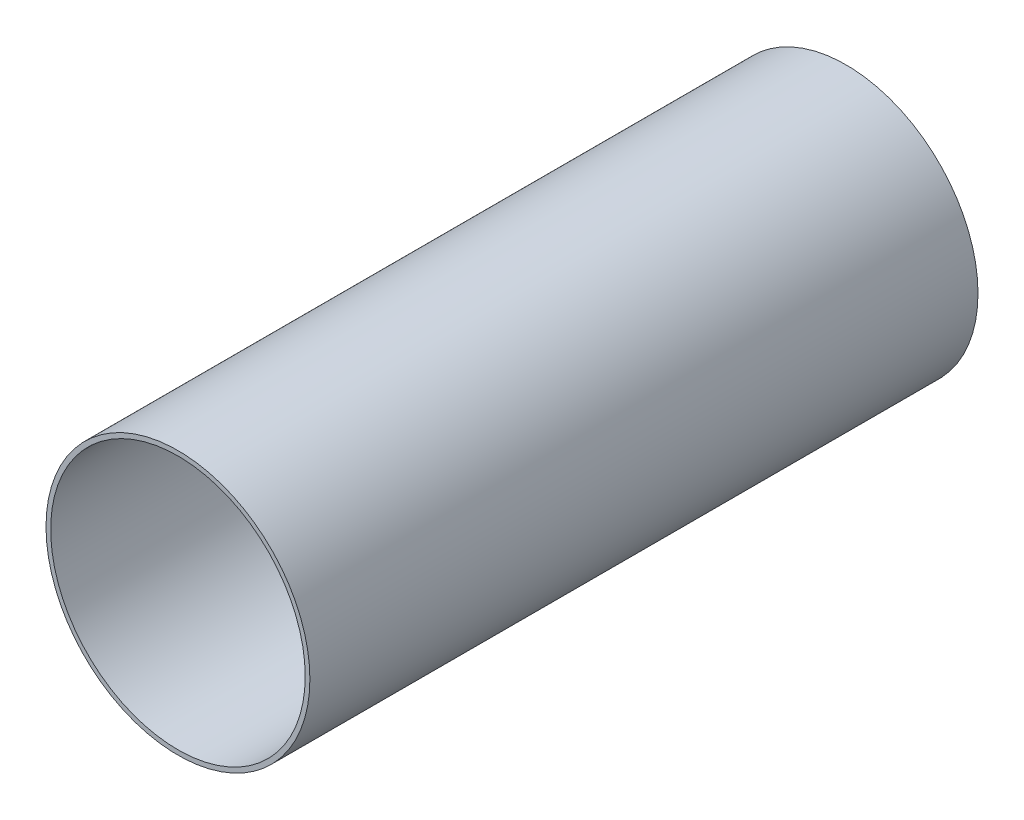
ISO-10303-21;
HEADER;
FILE_DESCRIPTION(('STEP AP214'),'2;1');
FILE_NAME('part.step','',(''),(''),'','','');
FILE_SCHEMA(('AUTOMOTIVE_DESIGN { 1 0 10303 214 1 1 1 1 }'));
ENDSEC;
DATA;
#1=APPLICATION_CONTEXT('core data for automotive mechanical design processes');
#2=APPLICATION_PROTOCOL_DEFINITION('international standard','automotive_design',2000,#1);
#3=PRODUCT_CONTEXT('',#1,'mechanical');
#4=PRODUCT('Part','Part','',(#3));
#5=PRODUCT_RELATED_PRODUCT_CATEGORY('part','',(#4));
#6=PRODUCT_DEFINITION_FORMATION('','',#4);
#7=PRODUCT_DEFINITION_CONTEXT('part definition',#1,'design');
#8=PRODUCT_DEFINITION('design','',#6,#7);
#9=PRODUCT_DEFINITION_SHAPE('','',#8);
#10=(LENGTH_UNIT() NAMED_UNIT(*) SI_UNIT(.MILLI.,.METRE.));
#11=(NAMED_UNIT(*) PLANE_ANGLE_UNIT() SI_UNIT($,.RADIAN.));
#12=(NAMED_UNIT(*) SI_UNIT($,.STERADIAN.) SOLID_ANGLE_UNIT());
#13=UNCERTAINTY_MEASURE_WITH_UNIT(LENGTH_MEASURE(1.E-05),#10,'distance_accuracy_value','');
#14=(GEOMETRIC_REPRESENTATION_CONTEXT(3) GLOBAL_UNCERTAINTY_ASSIGNED_CONTEXT((#13)) GLOBAL_UNIT_ASSIGNED_CONTEXT((#10,
#11,#12)) REPRESENTATION_CONTEXT('',''));
#15=CARTESIAN_POINT('',(0.,0.,0.));
#16=DIRECTION('',(0.,0.,1.));
#17=DIRECTION('',(1.,0.,0.));
#18=AXIS2_PLACEMENT_3D('',#15,#16,#17);
#19=CARTESIAN_POINT('',(0.,0.,200.));
#20=DIRECTION('',(0.,0.,1.));
#21=DIRECTION('',(1.,0.,0.));
#22=AXIS2_PLACEMENT_3D('',#19,#20,#21);
#23=PLANE('',#22);
#24=CARTESIAN_POINT('',(0.,0.,200.));
#25=DIRECTION('',(0.,0.,1.));
#26=DIRECTION('',(1.,0.,0.));
#27=AXIS2_PLACEMENT_3D('',#24,#25,#26);
#28=CIRCLE('',#27,39.5);
#29=CARTESIAN_POINT('',(39.5,0.,200.));
#30=VERTEX_POINT('',#29);
#31=EDGE_CURVE('E10',#30,#30,#28,.T.);
#32=ORIENTED_EDGE('',*,*,#31,.T.);
#33=EDGE_LOOP('',(#32));
#34=FACE_BOUND('',#33,.T.);
#35=CARTESIAN_POINT('',(0.,0.,200.));
#36=DIRECTION('',(0.,0.,1.));
#37=DIRECTION('',(1.,0.,0.));
#38=AXIS2_PLACEMENT_3D('',#35,#36,#37);
#39=CIRCLE('',#38,38.1);
#40=CARTESIAN_POINT('',(38.1,0.,200.));
#41=VERTEX_POINT('',#40);
#42=EDGE_CURVE('E42',#41,#41,#39,.T.);
#43=ORIENTED_EDGE('',*,*,#42,.F.);
#44=EDGE_LOOP('',(#43));
#45=FACE_BOUND('',#44,.T.);
#46=ADVANCED_FACE('F31',(#34,#45),#23,.T.);
#47=CARTESIAN_POINT('',(0.,0.,0.));
#48=DIRECTION('',(0.,0.,1.));
#49=DIRECTION('',(1.,0.,0.));
#50=AXIS2_PLACEMENT_3D('',#47,#48,#49);
#51=PLANE('',#50);
#52=CARTESIAN_POINT('',(0.,0.,0.));
#53=DIRECTION('',(0.,0.,1.));
#54=DIRECTION('',(1.,0.,0.));
#55=AXIS2_PLACEMENT_3D('',#52,#53,#54);
#56=CIRCLE('',#55,39.5);
#57=CARTESIAN_POINT('',(39.5,0.,0.));
#58=VERTEX_POINT('',#57);
#59=EDGE_CURVE('E35',#58,#58,#56,.T.);
#60=ORIENTED_EDGE('',*,*,#59,.F.);
#61=EDGE_LOOP('',(#60));
#62=FACE_BOUND('',#61,.T.);
#63=CARTESIAN_POINT('',(0.,0.,0.));
#64=DIRECTION('',(0.,0.,1.));
#65=DIRECTION('',(1.,0.,0.));
#66=AXIS2_PLACEMENT_3D('',#63,#64,#65);
#67=CIRCLE('',#66,38.1);
#68=CARTESIAN_POINT('',(38.1,0.,0.));
#69=VERTEX_POINT('',#68);
#70=EDGE_CURVE('E44',#69,#69,#67,.T.);
#71=ORIENTED_EDGE('',*,*,#70,.T.);
#72=EDGE_LOOP('',(#71));
#73=FACE_BOUND('',#72,.T.);
#74=ADVANCED_FACE('F54',(#62,#73),#51,.F.);
#75=CARTESIAN_POINT('',(0.,0.,200.));
#76=DIRECTION('',(0.,0.,-1.));
#77=DIRECTION('',(-1.,0.,0.));
#78=AXIS2_PLACEMENT_3D('',#75,#76,#77);
#79=CYLINDRICAL_SURFACE('',#78,39.5);
#80=ORIENTED_EDGE('',*,*,#31,.F.);
#81=EDGE_LOOP('',(#80));
#82=FACE_BOUND('',#81,.T.);
#83=ORIENTED_EDGE('',*,*,#59,.T.);
#84=EDGE_LOOP('',(#83));
#85=FACE_BOUND('',#84,.T.);
#86=ADVANCED_FACE('F33',(#82,#85),#79,.T.);
#87=CARTESIAN_POINT('',(0.,0.,200.));
#88=DIRECTION('',(0.,0.,-1.));
#89=DIRECTION('',(-1.,0.,0.));
#90=AXIS2_PLACEMENT_3D('',#87,#88,#89);
#91=CYLINDRICAL_SURFACE('',#90,38.1);
#92=ORIENTED_EDGE('',*,*,#42,.T.);
#93=EDGE_LOOP('',(#92));
#94=FACE_BOUND('',#93,.T.);
#95=ORIENTED_EDGE('',*,*,#70,.F.);
#96=EDGE_LOOP('',(#95));
#97=FACE_BOUND('',#96,.T.);
#98=ADVANCED_FACE('F50',(#94,#97),#91,.F.);
#99=CLOSED_SHELL('',(#46,#74,#86,#98));
#100=MANIFOLD_SOLID_BREP('B2',#99);
#101=ADVANCED_BREP_SHAPE_REPRESENTATION('',(#18,#100),#14);
#102=SHAPE_DEFINITION_REPRESENTATION(#9,#101);
ENDSEC;
END-ISO-10303-21;
